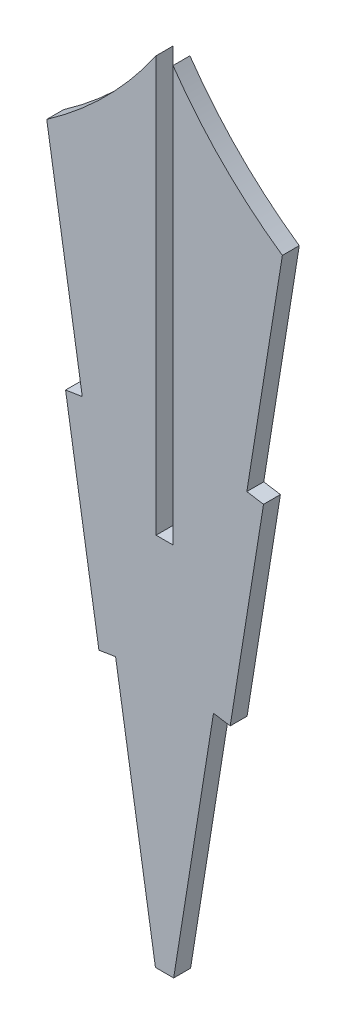
ISO-10303-21;
HEADER;
FILE_DESCRIPTION(('STEP AP214'),'2;1');
FILE_NAME('part.step','',(''),(''),'','','');
FILE_SCHEMA(('AUTOMOTIVE_DESIGN { 1 0 10303 214 1 1 1 1 }'));
ENDSEC;
DATA;
#1=APPLICATION_CONTEXT('core data for automotive mechanical design processes');
#2=APPLICATION_PROTOCOL_DEFINITION('international standard','automotive_design',2000,#1);
#3=PRODUCT_CONTEXT('',#1,'mechanical');
#4=PRODUCT('Part','Part','',(#3));
#5=PRODUCT_RELATED_PRODUCT_CATEGORY('part','',(#4));
#6=PRODUCT_DEFINITION_FORMATION('','',#4);
#7=PRODUCT_DEFINITION_CONTEXT('part definition',#1,'design');
#8=PRODUCT_DEFINITION('design','',#6,#7);
#9=PRODUCT_DEFINITION_SHAPE('','',#8);
#10=(LENGTH_UNIT() NAMED_UNIT(*) SI_UNIT(.MILLI.,.METRE.));
#11=(NAMED_UNIT(*) PLANE_ANGLE_UNIT() SI_UNIT($,.RADIAN.));
#12=(NAMED_UNIT(*) SI_UNIT($,.STERADIAN.) SOLID_ANGLE_UNIT());
#13=UNCERTAINTY_MEASURE_WITH_UNIT(LENGTH_MEASURE(1.E-05),#10,'distance_accuracy_value','');
#14=(GEOMETRIC_REPRESENTATION_CONTEXT(3) GLOBAL_UNCERTAINTY_ASSIGNED_CONTEXT((#13)) GLOBAL_UNIT_ASSIGNED_CONTEXT((#10,
#11,#12)) REPRESENTATION_CONTEXT('',''));
#15=CARTESIAN_POINT('',(0.,0.,0.));
#16=DIRECTION('',(0.,0.,1.));
#17=DIRECTION('',(1.,0.,0.));
#18=AXIS2_PLACEMENT_3D('',#15,#16,#17);
#19=CARTESIAN_POINT('',(-1.524,-185.062075143658,1.524));
#20=DIRECTION('',(-1.,0.,0.));
#21=DIRECTION('',(0.,-1.,0.));
#22=AXIS2_PLACEMENT_3D('',#19,#20,#21);
#23=PLANE('',#22);
#24=DIRECTION('',(0.,1.,0.));
#25=VECTOR('',#24,1.);
#26=CARTESIAN_POINT('',(-1.524,-185.062075143658,0.));
#27=LINE('',#26,#25);
#28=CARTESIAN_POINT('',(-1.524,-185.062075143658,0.));
#29=VERTEX_POINT('',#28);
#30=CARTESIAN_POINT('',(-1.524,-147.624689716417,0.));
#31=VERTEX_POINT('',#30);
#32=EDGE_CURVE('E187',#29,#31,#27,.T.);
#33=ORIENTED_EDGE('',*,*,#32,.T.);
#34=DIRECTION('',(0.,0.,-1.));
#35=VECTOR('',#34,1.);
#36=CARTESIAN_POINT('',(-1.524,-147.624689716417,1.524));
#37=LINE('',#36,#35);
#38=CARTESIAN_POINT('',(-1.524,-147.624689716417,1.524));
#39=VERTEX_POINT('',#38);
#40=EDGE_CURVE('E11',#39,#31,#37,.T.);
#41=ORIENTED_EDGE('',*,*,#40,.F.);
#42=DIRECTION('',(0.,1.,0.));
#43=VECTOR('',#42,1.);
#44=CARTESIAN_POINT('',(-1.524,-185.062075143658,1.524));
#45=LINE('',#44,#43);
#46=CARTESIAN_POINT('',(-1.524,-185.062075143658,1.524));
#47=VERTEX_POINT('',#46);
#48=EDGE_CURVE('E217',#47,#39,#45,.T.);
#49=ORIENTED_EDGE('',*,*,#48,.F.);
#50=DIRECTION('',(0.,0.,-1.));
#51=VECTOR('',#50,1.);
#52=CARTESIAN_POINT('',(-1.524,-185.062075143658,1.524));
#53=LINE('',#52,#51);
#54=EDGE_CURVE('E183',#47,#29,#53,.T.);
#55=ORIENTED_EDGE('',*,*,#54,.T.);
#56=EDGE_LOOP('',(#33,#41,#49,#55));
#57=FACE_BOUND('',#56,.T.);
#58=ADVANCED_FACE('F43',(#57),#23,.F.);
#59=CARTESIAN_POINT('',(-33.7965268122552,-125.330559965492,1.524));
#60=DIRECTION('',(0.,0.,-1.));
#61=DIRECTION('',(-1.,0.,0.));
#62=AXIS2_PLACEMENT_3D('',#59,#60,#61);
#63=CYLINDRICAL_SURFACE('',#62,39.2242808499891);
#64=CARTESIAN_POINT('',(-33.7965268122552,-125.330559965492,0.));
#65=DIRECTION('',(0.,0.,-1.));
#66=DIRECTION('',(-1.,0.,0.));
#67=AXIS2_PLACEMENT_3D('',#64,#65,#66);
#68=CIRCLE('',#67,39.2242808499891);
#69=CARTESIAN_POINT('',(-11.3846268829321,-157.521411923103,0.));
#70=VERTEX_POINT('',#69);
#71=EDGE_CURVE('E190',#31,#70,#68,.T.);
#72=ORIENTED_EDGE('',*,*,#71,.T.);
#73=DIRECTION('',(0.,0.,-1.));
#74=VECTOR('',#73,1.);
#75=CARTESIAN_POINT('',(-11.3846268829321,-157.521411923103,1.524));
#76=LINE('',#75,#74);
#77=CARTESIAN_POINT('',(-11.3846268829321,-157.521411923103,1.524));
#78=VERTEX_POINT('',#77);
#79=EDGE_CURVE('E51',#78,#70,#76,.T.);
#80=ORIENTED_EDGE('',*,*,#79,.F.);
#81=CARTESIAN_POINT('',(-33.7965268122552,-125.330559965492,1.524));
#82=DIRECTION('',(0.,0.,-1.));
#83=DIRECTION('',(-1.,0.,0.));
#84=AXIS2_PLACEMENT_3D('',#81,#82,#83);
#85=CIRCLE('',#84,39.2242808499891);
#86=EDGE_CURVE('E126',#39,#78,#85,.T.);
#87=ORIENTED_EDGE('',*,*,#86,.F.);
#88=ORIENTED_EDGE('',*,*,#40,.T.);
#89=EDGE_LOOP('',(#72,#80,#87,#88));
#90=FACE_BOUND('',#89,.T.);
#91=ADVANCED_FACE('F315',(#90),#63,.F.);
#92=CARTESIAN_POINT('',(-11.3846268829321,-157.521411923103,1.524));
#93=DIRECTION('',(0.987471824874861,0.157795421601235,0.));
#94=DIRECTION('',(-0.157795421601235,0.987471824874861,0.));
#95=AXIS2_PLACEMENT_3D('',#92,#93,#94);
#96=PLANE('',#95);
#97=DIRECTION('',(0.157795421601235,-0.987471824874861,0.));
#98=VECTOR('',#97,1.);
#99=CARTESIAN_POINT('',(-11.3846268829321,-157.521411923103,0.));
#100=LINE('',#99,#98);
#101=CARTESIAN_POINT('',(-8.18166695959184,-177.565293097898,0.));
#102=VERTEX_POINT('',#101);
#103=EDGE_CURVE('E192',#70,#102,#100,.T.);
#104=ORIENTED_EDGE('',*,*,#103,.T.);
#105=DIRECTION('',(0.,0.,-1.));
#106=VECTOR('',#105,1.);
#107=CARTESIAN_POINT('',(-8.18166695959184,-177.565293097898,1.524));
#108=LINE('',#107,#106);
#109=CARTESIAN_POINT('',(-8.18166695959184,-177.565293097898,1.524));
#110=VERTEX_POINT('',#109);
#111=EDGE_CURVE('E248',#110,#102,#108,.T.);
#112=ORIENTED_EDGE('',*,*,#111,.F.);
#113=DIRECTION('',(0.157795421601235,-0.987471824874861,0.));
#114=VECTOR('',#113,1.);
#115=CARTESIAN_POINT('',(-11.3846268829321,-157.521411923103,1.524));
#116=LINE('',#115,#114);
#117=EDGE_CURVE('E256',#78,#110,#116,.T.);
#118=ORIENTED_EDGE('',*,*,#117,.F.);
#119=ORIENTED_EDGE('',*,*,#79,.T.);
#120=EDGE_LOOP('',(#104,#112,#118,#119));
#121=FACE_BOUND('',#120,.T.);
#122=ADVANCED_FACE('F254',(#121),#96,.F.);
#123=CARTESIAN_POINT('',(-8.18166695959184,-177.565293097898,1.524));
#124=DIRECTION('',(0.157795421601243,-0.98747182487486,0.));
#125=DIRECTION('',(0.98747182487486,0.157795421601243,0.));
#126=AXIS2_PLACEMENT_3D('',#123,#124,#125);
#127=PLANE('',#126);
#128=DIRECTION('',(-0.98747182487486,-0.157795421601243,0.));
#129=VECTOR('',#128,1.);
#130=CARTESIAN_POINT('',(-8.18166695959184,-177.565293097898,0.));
#131=LINE('',#130,#129);
#132=CARTESIAN_POINT('',(-9.68657402070113,-177.805773320419,0.));
#133=VERTEX_POINT('',#132);
#134=EDGE_CURVE('E194',#102,#133,#131,.T.);
#135=ORIENTED_EDGE('',*,*,#134,.T.);
#136=DIRECTION('',(0.,0.,-1.));
#137=VECTOR('',#136,1.);
#138=CARTESIAN_POINT('',(-9.68657402070113,-177.805773320419,1.524));
#139=LINE('',#138,#137);
#140=CARTESIAN_POINT('',(-9.68657402070113,-177.805773320419,1.524));
#141=VERTEX_POINT('',#140);
#142=EDGE_CURVE('E245',#141,#133,#139,.T.);
#143=ORIENTED_EDGE('',*,*,#142,.F.);
#144=DIRECTION('',(-0.98747182487486,-0.157795421601243,0.));
#145=VECTOR('',#144,1.);
#146=CARTESIAN_POINT('',(-8.18166695959184,-177.565293097898,1.524));
#147=LINE('',#146,#145);
#148=EDGE_CURVE('E274',#110,#141,#147,.T.);
#149=ORIENTED_EDGE('',*,*,#148,.F.);
#150=ORIENTED_EDGE('',*,*,#111,.T.);
#151=EDGE_LOOP('',(#135,#143,#149,#150));
#152=FACE_BOUND('',#151,.T.);
#153=ADVANCED_FACE('F265',(#152),#127,.F.);
#154=CARTESIAN_POINT('',(-9.68657402070113,-177.805773320419,1.524));
#155=DIRECTION('',(0.987471824874861,0.157795421601235,0.));
#156=DIRECTION('',(-0.157795421601235,0.987471824874861,0.));
#157=AXIS2_PLACEMENT_3D('',#154,#155,#156);
#158=PLANE('',#157);
#159=DIRECTION('',(0.157795421601235,-0.987471824874861,0.));
#160=VECTOR('',#159,1.);
#161=CARTESIAN_POINT('',(-9.68657402070113,-177.805773320419,0.));
#162=LINE('',#161,#160);
#163=CARTESIAN_POINT('',(-6.6805712391976,-196.617111584285,0.));
#164=VERTEX_POINT('',#163);
#165=EDGE_CURVE('E196',#133,#164,#162,.T.);
#166=ORIENTED_EDGE('',*,*,#165,.T.);
#167=DIRECTION('',(0.,0.,-1.));
#168=VECTOR('',#167,1.);
#169=CARTESIAN_POINT('',(-6.6805712391976,-196.617111584285,1.524));
#170=LINE('',#169,#168);
#171=CARTESIAN_POINT('',(-6.6805712391976,-196.617111584285,1.524));
#172=VERTEX_POINT('',#171);
#173=EDGE_CURVE('E242',#172,#164,#170,.T.);
#174=ORIENTED_EDGE('',*,*,#173,.F.);
#175=DIRECTION('',(0.157795421601235,-0.987471824874861,0.));
#176=VECTOR('',#175,1.);
#177=CARTESIAN_POINT('',(-9.68657402070113,-177.805773320419,1.524));
#178=LINE('',#177,#176);
#179=EDGE_CURVE('E271',#141,#172,#178,.T.);
#180=ORIENTED_EDGE('',*,*,#179,.F.);
#181=ORIENTED_EDGE('',*,*,#142,.T.);
#182=EDGE_LOOP('',(#166,#174,#180,#181));
#183=FACE_BOUND('',#182,.T.);
#184=ADVANCED_FACE('F269',(#183),#158,.F.);
#185=CARTESIAN_POINT('',(-5.17566417808831,-196.376631361764,1.524));
#186=DIRECTION('',(-0.157795421601243,0.98747182487486,0.));
#187=DIRECTION('',(-0.98747182487486,-0.157795421601243,0.));
#188=AXIS2_PLACEMENT_3D('',#185,#186,#187);
#189=PLANE('',#188);
#190=DIRECTION('',(0.98747182487486,0.157795421601243,0.));
#191=VECTOR('',#190,1.);
#192=CARTESIAN_POINT('',(-5.17566417808831,-196.376631361764,0.));
#193=LINE('',#192,#191);
#194=CARTESIAN_POINT('',(-5.17566417808831,-196.376631361764,0.));
#195=VERTEX_POINT('',#194);
#196=EDGE_CURVE('E198',#164,#195,#193,.T.);
#197=ORIENTED_EDGE('',*,*,#196,.T.);
#198=DIRECTION('',(0.,0.,-1.));
#199=VECTOR('',#198,1.);
#200=CARTESIAN_POINT('',(-5.17566417808831,-196.376631361764,1.524));
#201=LINE('',#200,#199);
#202=CARTESIAN_POINT('',(-5.17566417808831,-196.376631361764,1.524));
#203=VERTEX_POINT('',#202);
#204=EDGE_CURVE('E239',#203,#195,#201,.T.);
#205=ORIENTED_EDGE('',*,*,#204,.F.);
#206=DIRECTION('',(0.98747182487486,0.157795421601243,0.));
#207=VECTOR('',#206,1.);
#208=CARTESIAN_POINT('',(-5.17566417808831,-196.376631361764,1.524));
#209=LINE('',#208,#207);
#210=EDGE_CURVE('E273',#172,#203,#209,.T.);
#211=ORIENTED_EDGE('',*,*,#210,.F.);
#212=ORIENTED_EDGE('',*,*,#173,.T.);
#213=EDGE_LOOP('',(#197,#205,#211,#212));
#214=FACE_BOUND('',#213,.T.);
#215=ADVANCED_FACE('F328',(#214),#189,.F.);
#216=CARTESIAN_POINT('',(-5.17566417808831,-196.376631361764,1.524));
#217=DIRECTION('',(0.987471824874861,0.157795421601235,0.));
#218=DIRECTION('',(-0.157795421601235,0.987471824874861,0.));
#219=AXIS2_PLACEMENT_3D('',#216,#217,#218);
#220=PLANE('',#219);
#221=DIRECTION('',(0.157795421601235,-0.987471824874861,0.));
#222=VECTOR('',#221,1.);
#223=CARTESIAN_POINT('',(-5.17566417808831,-196.376631361764,0.));
#224=LINE('',#223,#222);
#225=CARTESIAN_POINT('',(-1.58511702127162,-218.846004156376,0.));
#226=VERTEX_POINT('',#225);
#227=EDGE_CURVE('E200',#195,#226,#224,.T.);
#228=ORIENTED_EDGE('',*,*,#227,.T.);
#229=DIRECTION('',(0.,0.,-1.));
#230=VECTOR('',#229,1.);
#231=CARTESIAN_POINT('',(-1.58511702127162,-218.846004156376,1.524));
#232=LINE('',#231,#230);
#233=CARTESIAN_POINT('',(-1.58511702127162,-218.846004156376,1.524));
#234=VERTEX_POINT('',#233);
#235=EDGE_CURVE('E236',#234,#226,#232,.T.);
#236=ORIENTED_EDGE('',*,*,#235,.F.);
#237=DIRECTION('',(0.157795421601235,-0.987471824874861,0.));
#238=VECTOR('',#237,1.);
#239=CARTESIAN_POINT('',(-5.17566417808831,-196.376631361764,1.524));
#240=LINE('',#239,#238);
#241=EDGE_CURVE('E276',#203,#234,#240,.T.);
#242=ORIENTED_EDGE('',*,*,#241,.F.);
#243=ORIENTED_EDGE('',*,*,#204,.T.);
#244=EDGE_LOOP('',(#228,#236,#242,#243));
#245=FACE_BOUND('',#244,.T.);
#246=ADVANCED_FACE('F331',(#245),#220,.F.);
#247=CARTESIAN_POINT('',(-1.58511702127162,-218.846004156376,1.524));
#248=DIRECTION('',(0.,1.,0.));
#249=DIRECTION('',(0.,0.,1.));
#250=AXIS2_PLACEMENT_3D('',#247,#248,#249);
#251=PLANE('',#250);
#252=DIRECTION('',(1.,0.,0.));
#253=VECTOR('',#252,1.);
#254=CARTESIAN_POINT('',(-1.58511702127162,-218.846004156376,0.));
#255=LINE('',#254,#253);
#256=CARTESIAN_POINT('',(0.0611170212716098,-218.846004156376,0.));
#257=VERTEX_POINT('',#256);
#258=EDGE_CURVE('E202',#226,#257,#255,.T.);
#259=ORIENTED_EDGE('',*,*,#258,.T.);
#260=DIRECTION('',(0.,0.,-1.));
#261=VECTOR('',#260,1.);
#262=CARTESIAN_POINT('',(0.0611170212716098,-218.846004156376,1.524));
#263=LINE('',#262,#261);
#264=CARTESIAN_POINT('',(0.0611170212716098,-218.846004156376,1.524));
#265=VERTEX_POINT('',#264);
#266=EDGE_CURVE('E233',#265,#257,#263,.T.);
#267=ORIENTED_EDGE('',*,*,#266,.F.);
#268=DIRECTION('',(1.,0.,0.));
#269=VECTOR('',#268,1.);
#270=CARTESIAN_POINT('',(-1.58511702127162,-218.846004156376,1.524));
#271=LINE('',#270,#269);
#272=EDGE_CURVE('E282',#234,#265,#271,.T.);
#273=ORIENTED_EDGE('',*,*,#272,.F.);
#274=ORIENTED_EDGE('',*,*,#235,.T.);
#275=EDGE_LOOP('',(#259,#267,#273,#274));
#276=FACE_BOUND('',#275,.T.);
#277=ADVANCED_FACE('F335',(#276),#251,.F.);
#278=CARTESIAN_POINT('',(3.65166417808831,-196.376631361764,1.524));
#279=DIRECTION('',(-0.987471824874861,0.157795421601235,0.));
#280=DIRECTION('',(-0.157795421601235,-0.987471824874861,0.));
#281=AXIS2_PLACEMENT_3D('',#278,#279,#280);
#282=PLANE('',#281);
#283=DIRECTION('',(0.157795421601235,0.987471824874861,0.));
#284=VECTOR('',#283,1.);
#285=CARTESIAN_POINT('',(3.65166417808831,-196.376631361764,0.));
#286=LINE('',#285,#284);
#287=CARTESIAN_POINT('',(3.65166417808831,-196.376631361764,0.));
#288=VERTEX_POINT('',#287);
#289=EDGE_CURVE('E204',#257,#288,#286,.T.);
#290=ORIENTED_EDGE('',*,*,#289,.T.);
#291=DIRECTION('',(0.,0.,-1.));
#292=VECTOR('',#291,1.);
#293=CARTESIAN_POINT('',(3.65166417808831,-196.376631361764,1.524));
#294=LINE('',#293,#292);
#295=CARTESIAN_POINT('',(3.65166417808831,-196.376631361764,1.524));
#296=VERTEX_POINT('',#295);
#297=EDGE_CURVE('E230',#296,#288,#294,.T.);
#298=ORIENTED_EDGE('',*,*,#297,.F.);
#299=DIRECTION('',(0.157795421601235,0.987471824874861,0.));
#300=VECTOR('',#299,1.);
#301=CARTESIAN_POINT('',(3.65166417808831,-196.376631361764,1.524));
#302=LINE('',#301,#300);
#303=EDGE_CURVE('E284',#265,#296,#302,.T.);
#304=ORIENTED_EDGE('',*,*,#303,.F.);
#305=ORIENTED_EDGE('',*,*,#266,.T.);
#306=EDGE_LOOP('',(#290,#298,#304,#305));
#307=FACE_BOUND('',#306,.T.);
#308=ADVANCED_FACE('F339',(#307),#282,.F.);
#309=CARTESIAN_POINT('',(3.65166417808831,-196.376631361764,1.524));
#310=DIRECTION('',(0.157795421601243,0.98747182487486,0.));
#311=DIRECTION('',(-0.98747182487486,0.157795421601243,0.));
#312=AXIS2_PLACEMENT_3D('',#309,#310,#311);
#313=PLANE('',#312);
#314=DIRECTION('',(0.98747182487486,-0.157795421601243,0.));
#315=VECTOR('',#314,1.);
#316=CARTESIAN_POINT('',(3.65166417808831,-196.376631361764,0.));
#317=LINE('',#316,#315);
#318=CARTESIAN_POINT('',(5.1565712391976,-196.617111584285,0.));
#319=VERTEX_POINT('',#318);
#320=EDGE_CURVE('E206',#288,#319,#317,.T.);
#321=ORIENTED_EDGE('',*,*,#320,.T.);
#322=DIRECTION('',(0.,0.,-1.));
#323=VECTOR('',#322,1.);
#324=CARTESIAN_POINT('',(5.1565712391976,-196.617111584285,1.524));
#325=LINE('',#324,#323);
#326=CARTESIAN_POINT('',(5.1565712391976,-196.617111584285,1.524));
#327=VERTEX_POINT('',#326);
#328=EDGE_CURVE('E227',#327,#319,#325,.T.);
#329=ORIENTED_EDGE('',*,*,#328,.F.);
#330=DIRECTION('',(0.98747182487486,-0.157795421601243,0.));
#331=VECTOR('',#330,1.);
#332=CARTESIAN_POINT('',(3.65166417808831,-196.376631361764,1.524));
#333=LINE('',#332,#331);
#334=EDGE_CURVE('E286',#296,#327,#333,.T.);
#335=ORIENTED_EDGE('',*,*,#334,.F.);
#336=ORIENTED_EDGE('',*,*,#297,.T.);
#337=EDGE_LOOP('',(#321,#329,#335,#336));
#338=FACE_BOUND('',#337,.T.);
#339=ADVANCED_FACE('F343',(#338),#313,.F.);
#340=CARTESIAN_POINT('',(8.16257402070113,-177.805773320419,1.524));
#341=DIRECTION('',(-0.987471824874861,0.157795421601235,0.));
#342=DIRECTION('',(-0.157795421601235,-0.987471824874861,0.));
#343=AXIS2_PLACEMENT_3D('',#340,#341,#342);
#344=PLANE('',#343);
#345=DIRECTION('',(0.157795421601235,0.987471824874861,0.));
#346=VECTOR('',#345,1.);
#347=CARTESIAN_POINT('',(8.16257402070113,-177.805773320419,0.));
#348=LINE('',#347,#346);
#349=CARTESIAN_POINT('',(8.16257402070113,-177.805773320419,0.));
#350=VERTEX_POINT('',#349);
#351=EDGE_CURVE('E208',#319,#350,#348,.T.);
#352=ORIENTED_EDGE('',*,*,#351,.T.);
#353=DIRECTION('',(0.,0.,-1.));
#354=VECTOR('',#353,1.);
#355=CARTESIAN_POINT('',(8.16257402070113,-177.805773320419,1.524));
#356=LINE('',#355,#354);
#357=CARTESIAN_POINT('',(8.16257402070113,-177.805773320419,1.524));
#358=VERTEX_POINT('',#357);
#359=EDGE_CURVE('E224',#358,#350,#356,.T.);
#360=ORIENTED_EDGE('',*,*,#359,.F.);
#361=DIRECTION('',(0.157795421601235,0.987471824874861,0.));
#362=VECTOR('',#361,1.);
#363=CARTESIAN_POINT('',(8.16257402070113,-177.805773320419,1.524));
#364=LINE('',#363,#362);
#365=EDGE_CURVE('E288',#327,#358,#364,.T.);
#366=ORIENTED_EDGE('',*,*,#365,.F.);
#367=ORIENTED_EDGE('',*,*,#328,.T.);
#368=EDGE_LOOP('',(#352,#360,#366,#367));
#369=FACE_BOUND('',#368,.T.);
#370=ADVANCED_FACE('F347',(#369),#344,.F.);
#371=CARTESIAN_POINT('',(6.65766695959183,-177.565293097898,1.524));
#372=DIRECTION('',(-0.157795421601243,-0.98747182487486,0.));
#373=DIRECTION('',(0.98747182487486,-0.157795421601243,0.));
#374=AXIS2_PLACEMENT_3D('',#371,#372,#373);
#375=PLANE('',#374);
#376=DIRECTION('',(-0.98747182487486,0.157795421601243,0.));
#377=VECTOR('',#376,1.);
#378=CARTESIAN_POINT('',(6.65766695959183,-177.565293097898,0.));
#379=LINE('',#378,#377);
#380=CARTESIAN_POINT('',(6.65766695959183,-177.565293097898,0.));
#381=VERTEX_POINT('',#380);
#382=EDGE_CURVE('E210',#350,#381,#379,.T.);
#383=ORIENTED_EDGE('',*,*,#382,.T.);
#384=DIRECTION('',(0.,0.,-1.));
#385=VECTOR('',#384,1.);
#386=CARTESIAN_POINT('',(6.65766695959183,-177.565293097898,1.524));
#387=LINE('',#386,#385);
#388=CARTESIAN_POINT('',(6.65766695959183,-177.565293097898,1.524));
#389=VERTEX_POINT('',#388);
#390=EDGE_CURVE('E221',#389,#381,#387,.T.);
#391=ORIENTED_EDGE('',*,*,#390,.F.);
#392=DIRECTION('',(-0.98747182487486,0.157795421601243,0.));
#393=VECTOR('',#392,1.);
#394=CARTESIAN_POINT('',(6.65766695959183,-177.565293097898,1.524));
#395=LINE('',#394,#393);
#396=EDGE_CURVE('E290',#358,#389,#395,.T.);
#397=ORIENTED_EDGE('',*,*,#396,.F.);
#398=ORIENTED_EDGE('',*,*,#359,.T.);
#399=EDGE_LOOP('',(#383,#391,#397,#398));
#400=FACE_BOUND('',#399,.T.);
#401=ADVANCED_FACE('F296',(#400),#375,.F.);
#402=CARTESIAN_POINT('',(9.86062688293212,-157.521411923103,1.524));
#403=DIRECTION('',(-0.987471824874861,0.157795421601235,0.));
#404=DIRECTION('',(-0.157795421601235,-0.987471824874861,0.));
#405=AXIS2_PLACEMENT_3D('',#402,#403,#404);
#406=PLANE('',#405);
#407=DIRECTION('',(0.157795421601235,0.987471824874861,0.));
#408=VECTOR('',#407,1.);
#409=CARTESIAN_POINT('',(9.86062688293212,-157.521411923103,0.));
#410=LINE('',#409,#408);
#411=CARTESIAN_POINT('',(9.86062688293211,-157.521411923103,0.));
#412=VERTEX_POINT('',#411);
#413=EDGE_CURVE('E212',#381,#412,#410,.T.);
#414=ORIENTED_EDGE('',*,*,#413,.T.);
#415=DIRECTION('',(0.,0.,-1.));
#416=VECTOR('',#415,1.);
#417=CARTESIAN_POINT('',(9.86062688293211,-157.521411923103,1.524));
#418=LINE('',#417,#416);
#419=CARTESIAN_POINT('',(9.86062688293211,-157.521411923103,1.524));
#420=VERTEX_POINT('',#419);
#421=EDGE_CURVE('E178',#420,#412,#418,.T.);
#422=ORIENTED_EDGE('',*,*,#421,.F.);
#423=DIRECTION('',(0.157795421601235,0.987471824874861,0.));
#424=VECTOR('',#423,1.);
#425=CARTESIAN_POINT('',(9.86062688293212,-157.521411923103,1.524));
#426=LINE('',#425,#424);
#427=EDGE_CURVE('E169',#389,#420,#426,.T.);
#428=ORIENTED_EDGE('',*,*,#427,.F.);
#429=ORIENTED_EDGE('',*,*,#390,.T.);
#430=EDGE_LOOP('',(#414,#422,#428,#429));
#431=FACE_BOUND('',#430,.T.);
#432=ADVANCED_FACE('F300',(#431),#406,.F.);
#433=CARTESIAN_POINT('',(32.2725268122552,-125.330559965492,1.524));
#434=DIRECTION('',(0.,0.,-1.));
#435=DIRECTION('',(-1.,0.,0.));
#436=AXIS2_PLACEMENT_3D('',#433,#434,#435);
#437=CYLINDRICAL_SURFACE('',#436,39.2242808499891);
#438=CARTESIAN_POINT('',(32.2725268122552,-125.330559965492,0.));
#439=DIRECTION('',(0.,0.,-1.));
#440=DIRECTION('',(1.,0.,0.));
#441=AXIS2_PLACEMENT_3D('',#438,#439,#440);
#442=CIRCLE('',#441,39.2242808499891);
#443=CARTESIAN_POINT('',(0.,-147.624689716417,0.));
#444=VERTEX_POINT('',#443);
#445=EDGE_CURVE('E177',#412,#444,#442,.T.);
#446=ORIENTED_EDGE('',*,*,#445,.T.);
#447=DIRECTION('',(0.,0.,-1.));
#448=VECTOR('',#447,1.);
#449=CARTESIAN_POINT('',(0.,-147.624689716417,1.524));
#450=LINE('',#449,#448);
#451=CARTESIAN_POINT('',(0.,-147.624689716417,1.524));
#452=VERTEX_POINT('',#451);
#453=EDGE_CURVE('E174',#452,#444,#450,.T.);
#454=ORIENTED_EDGE('',*,*,#453,.F.);
#455=CARTESIAN_POINT('',(32.2725268122552,-125.330559965492,1.524));
#456=DIRECTION('',(0.,0.,-1.));
#457=DIRECTION('',(1.,0.,0.));
#458=AXIS2_PLACEMENT_3D('',#455,#456,#457);
#459=CIRCLE('',#458,39.2242808499891);
#460=EDGE_CURVE('E163',#420,#452,#459,.T.);
#461=ORIENTED_EDGE('',*,*,#460,.F.);
#462=ORIENTED_EDGE('',*,*,#421,.T.);
#463=EDGE_LOOP('',(#446,#454,#461,#462));
#464=FACE_BOUND('',#463,.T.);
#465=ADVANCED_FACE('F175',(#464),#437,.F.);
#466=CARTESIAN_POINT('',(0.,-185.062075143658,1.524));
#467=DIRECTION('',(1.,0.,0.));
#468=DIRECTION('',(0.,1.,0.));
#469=AXIS2_PLACEMENT_3D('',#466,#467,#468);
#470=PLANE('',#469);
#471=DIRECTION('',(0.,-1.,0.));
#472=VECTOR('',#471,1.);
#473=CARTESIAN_POINT('',(0.,-185.062075143658,0.));
#474=LINE('',#473,#472);
#475=CARTESIAN_POINT('',(0.,-185.062075143658,0.));
#476=VERTEX_POINT('',#475);
#477=EDGE_CURVE('E112',#444,#476,#474,.T.);
#478=ORIENTED_EDGE('',*,*,#477,.T.);
#479=DIRECTION('',(0.,0.,-1.));
#480=VECTOR('',#479,1.);
#481=CARTESIAN_POINT('',(0.,-185.062075143658,1.524));
#482=LINE('',#481,#480);
#483=CARTESIAN_POINT('',(0.,-185.062075143658,1.524));
#484=VERTEX_POINT('',#483);
#485=EDGE_CURVE('E179',#484,#476,#482,.T.);
#486=ORIENTED_EDGE('',*,*,#485,.F.);
#487=DIRECTION('',(0.,-1.,0.));
#488=VECTOR('',#487,1.);
#489=CARTESIAN_POINT('',(0.,-185.062075143658,1.524));
#490=LINE('',#489,#488);
#491=EDGE_CURVE('E167',#452,#484,#490,.T.);
#492=ORIENTED_EDGE('',*,*,#491,.F.);
#493=ORIENTED_EDGE('',*,*,#453,.T.);
#494=EDGE_LOOP('',(#478,#486,#492,#493));
#495=FACE_BOUND('',#494,.T.);
#496=ADVANCED_FACE('F181',(#495),#470,.F.);
#497=CARTESIAN_POINT('',(0.,-185.062075143658,1.524));
#498=DIRECTION('',(0.,-1.,0.));
#499=DIRECTION('',(0.,0.,-1.));
#500=AXIS2_PLACEMENT_3D('',#497,#498,#499);
#501=PLANE('',#500);
#502=DIRECTION('',(-1.,0.,0.));
#503=VECTOR('',#502,1.);
#504=CARTESIAN_POINT('',(0.,-185.062075143658,0.));
#505=LINE('',#504,#503);
#506=EDGE_CURVE('E118',#476,#29,#505,.T.);
#507=ORIENTED_EDGE('',*,*,#506,.T.);
#508=ORIENTED_EDGE('',*,*,#54,.F.);
#509=DIRECTION('',(-1.,0.,0.));
#510=VECTOR('',#509,1.);
#511=CARTESIAN_POINT('',(0.,-185.062075143658,1.524));
#512=LINE('',#511,#510);
#513=EDGE_CURVE('E59',#484,#47,#512,.T.);
#514=ORIENTED_EDGE('',*,*,#513,.F.);
#515=ORIENTED_EDGE('',*,*,#485,.T.);
#516=EDGE_LOOP('',(#507,#508,#514,#515));
#517=FACE_BOUND('',#516,.T.);
#518=ADVANCED_FACE('F304',(#517),#501,.F.);
#519=CARTESIAN_POINT('',(-33.7965268122552,-125.330559965492,1.524));
#520=DIRECTION('',(0.,0.,-1.));
#521=DIRECTION('',(-1.,0.,0.));
#522=AXIS2_PLACEMENT_3D('',#519,#520,#521);
#523=PLANE('',#522);
#524=ORIENTED_EDGE('',*,*,#48,.T.);
#525=ORIENTED_EDGE('',*,*,#86,.T.);
#526=ORIENTED_EDGE('',*,*,#117,.T.);
#527=ORIENTED_EDGE('',*,*,#148,.T.);
#528=ORIENTED_EDGE('',*,*,#179,.T.);
#529=ORIENTED_EDGE('',*,*,#210,.T.);
#530=ORIENTED_EDGE('',*,*,#241,.T.);
#531=ORIENTED_EDGE('',*,*,#272,.T.);
#532=ORIENTED_EDGE('',*,*,#303,.T.);
#533=ORIENTED_EDGE('',*,*,#334,.T.);
#534=ORIENTED_EDGE('',*,*,#365,.T.);
#535=ORIENTED_EDGE('',*,*,#396,.T.);
#536=ORIENTED_EDGE('',*,*,#427,.T.);
#537=ORIENTED_EDGE('',*,*,#460,.T.);
#538=ORIENTED_EDGE('',*,*,#491,.T.);
#539=ORIENTED_EDGE('',*,*,#513,.T.);
#540=EDGE_LOOP('',(#524,#525,#526,#527,#528,#529,#530,#531,#532,#533,#534,#535,#536,#537,#538,#539));
#541=FACE_BOUND('',#540,.T.);
#542=ADVANCED_FACE('F165',(#541),#523,.F.);
#543=CARTESIAN_POINT('',(-33.7965268122552,-125.330559965492,0.));
#544=DIRECTION('',(0.,0.,-1.));
#545=DIRECTION('',(-1.,0.,0.));
#546=AXIS2_PLACEMENT_3D('',#543,#544,#545);
#547=PLANE('',#546);
#548=ORIENTED_EDGE('',*,*,#32,.F.);
#549=ORIENTED_EDGE('',*,*,#506,.F.);
#550=ORIENTED_EDGE('',*,*,#477,.F.);
#551=ORIENTED_EDGE('',*,*,#445,.F.);
#552=ORIENTED_EDGE('',*,*,#413,.F.);
#553=ORIENTED_EDGE('',*,*,#382,.F.);
#554=ORIENTED_EDGE('',*,*,#351,.F.);
#555=ORIENTED_EDGE('',*,*,#320,.F.);
#556=ORIENTED_EDGE('',*,*,#289,.F.);
#557=ORIENTED_EDGE('',*,*,#258,.F.);
#558=ORIENTED_EDGE('',*,*,#227,.F.);
#559=ORIENTED_EDGE('',*,*,#196,.F.);
#560=ORIENTED_EDGE('',*,*,#165,.F.);
#561=ORIENTED_EDGE('',*,*,#134,.F.);
#562=ORIENTED_EDGE('',*,*,#103,.F.);
#563=ORIENTED_EDGE('',*,*,#71,.F.);
#564=EDGE_LOOP('',(#548,#549,#550,#551,#552,#553,#554,#555,#556,#557,#558,#559,#560,#561,#562,#563));
#565=FACE_BOUND('',#564,.T.);
#566=ADVANCED_FACE('F260',(#565),#547,.T.);
#567=CLOSED_SHELL('',(#58,#91,#122,#153,#184,#215,#246,#277,#308,#339,#370,#401,#432,#465,#496,
#518,#542,#566));
#568=MANIFOLD_SOLID_BREP('B2',#567);
#569=ADVANCED_BREP_SHAPE_REPRESENTATION('',(#18,#568),#14);
#570=SHAPE_DEFINITION_REPRESENTATION(#9,#569);
ENDSEC;
END-ISO-10303-21;
